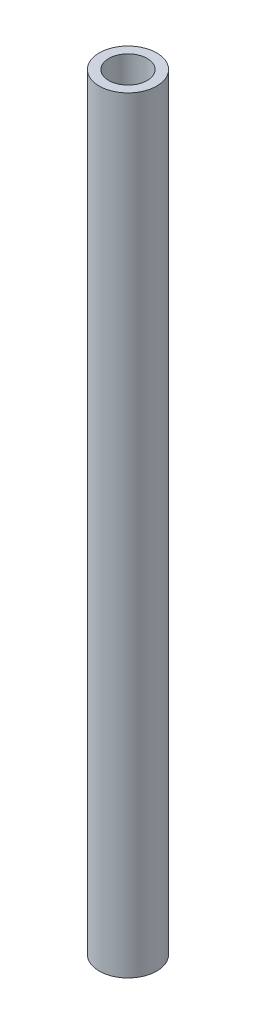
ISO-10303-21;
HEADER;
FILE_DESCRIPTION(('STEP AP214'),'2;1');
FILE_NAME('part.step','',(''),(''),'','','');
FILE_SCHEMA(('AUTOMOTIVE_DESIGN { 1 0 10303 214 1 1 1 1 }'));
ENDSEC;
DATA;
#1=APPLICATION_CONTEXT('core data for automotive mechanical design processes');
#2=APPLICATION_PROTOCOL_DEFINITION('international standard','automotive_design',2000,#1);
#3=PRODUCT_CONTEXT('',#1,'mechanical');
#4=PRODUCT('Part','Part','',(#3));
#5=PRODUCT_RELATED_PRODUCT_CATEGORY('part','',(#4));
#6=PRODUCT_DEFINITION_FORMATION('','',#4);
#7=PRODUCT_DEFINITION_CONTEXT('part definition',#1,'design');
#8=PRODUCT_DEFINITION('design','',#6,#7);
#9=PRODUCT_DEFINITION_SHAPE('','',#8);
#10=(LENGTH_UNIT() NAMED_UNIT(*) SI_UNIT(.MILLI.,.METRE.));
#11=(NAMED_UNIT(*) PLANE_ANGLE_UNIT() SI_UNIT($,.RADIAN.));
#12=(NAMED_UNIT(*) SI_UNIT($,.STERADIAN.) SOLID_ANGLE_UNIT());
#13=UNCERTAINTY_MEASURE_WITH_UNIT(LENGTH_MEASURE(1.E-05),#10,'distance_accuracy_value','');
#14=(GEOMETRIC_REPRESENTATION_CONTEXT(3) GLOBAL_UNCERTAINTY_ASSIGNED_CONTEXT((#13)) GLOBAL_UNIT_ASSIGNED_CONTEXT((#10,
#11,#12)) REPRESENTATION_CONTEXT('',''));
#15=CARTESIAN_POINT('',(0.,0.,0.));
#16=DIRECTION('',(0.,0.,1.));
#17=DIRECTION('',(1.,0.,0.));
#18=AXIS2_PLACEMENT_3D('',#15,#16,#17);
#19=CARTESIAN_POINT('',(0.,400.,0.));
#20=DIRECTION('',(0.,1.,0.));
#21=DIRECTION('',(0.,0.,1.));
#22=AXIS2_PLACEMENT_3D('',#19,#20,#21);
#23=PLANE('',#22);
#24=CARTESIAN_POINT('',(0.,400.,0.));
#25=DIRECTION('',(0.,1.,0.));
#26=DIRECTION('',(0.,0.,1.));
#27=AXIS2_PLACEMENT_3D('',#24,#25,#26);
#28=CIRCLE('',#27,15.);
#29=CARTESIAN_POINT('',(0.,400.,15.));
#30=VERTEX_POINT('',#29);
#31=EDGE_CURVE('E10',#30,#30,#28,.T.);
#32=ORIENTED_EDGE('',*,*,#31,.T.);
#33=EDGE_LOOP('',(#32));
#34=FACE_BOUND('',#33,.T.);
#35=CARTESIAN_POINT('',(0.,400.,0.));
#36=DIRECTION('',(0.,1.,0.));
#37=DIRECTION('',(0.,0.,1.));
#38=AXIS2_PLACEMENT_3D('',#35,#36,#37);
#39=CIRCLE('',#38,10.);
#40=CARTESIAN_POINT('',(0.,400.,10.));
#41=VERTEX_POINT('',#40);
#42=EDGE_CURVE('E42',#41,#41,#39,.T.);
#43=ORIENTED_EDGE('',*,*,#42,.F.);
#44=EDGE_LOOP('',(#43));
#45=FACE_BOUND('',#44,.T.);
#46=ADVANCED_FACE('F31',(#34,#45),#23,.T.);
#47=CARTESIAN_POINT('',(0.,0.,0.));
#48=DIRECTION('',(0.,1.,0.));
#49=DIRECTION('',(0.,0.,1.));
#50=AXIS2_PLACEMENT_3D('',#47,#48,#49);
#51=PLANE('',#50);
#52=CARTESIAN_POINT('',(0.,0.,0.));
#53=DIRECTION('',(0.,1.,0.));
#54=DIRECTION('',(0.,0.,1.));
#55=AXIS2_PLACEMENT_3D('',#52,#53,#54);
#56=CIRCLE('',#55,15.);
#57=CARTESIAN_POINT('',(0.,0.,15.));
#58=VERTEX_POINT('',#57);
#59=EDGE_CURVE('E35',#58,#58,#56,.T.);
#60=ORIENTED_EDGE('',*,*,#59,.F.);
#61=EDGE_LOOP('',(#60));
#62=FACE_BOUND('',#61,.T.);
#63=CARTESIAN_POINT('',(0.,0.,0.));
#64=DIRECTION('',(0.,1.,0.));
#65=DIRECTION('',(0.,0.,1.));
#66=AXIS2_PLACEMENT_3D('',#63,#64,#65);
#67=CIRCLE('',#66,10.);
#68=CARTESIAN_POINT('',(0.,0.,10.));
#69=VERTEX_POINT('',#68);
#70=EDGE_CURVE('E44',#69,#69,#67,.T.);
#71=ORIENTED_EDGE('',*,*,#70,.T.);
#72=EDGE_LOOP('',(#71));
#73=FACE_BOUND('',#72,.T.);
#74=ADVANCED_FACE('F54',(#62,#73),#51,.F.);
#75=CARTESIAN_POINT('',(0.,400.,0.));
#76=DIRECTION('',(0.,-1.,0.));
#77=DIRECTION('',(0.,0.,-1.));
#78=AXIS2_PLACEMENT_3D('',#75,#76,#77);
#79=CYLINDRICAL_SURFACE('',#78,15.);
#80=ORIENTED_EDGE('',*,*,#31,.F.);
#81=EDGE_LOOP('',(#80));
#82=FACE_BOUND('',#81,.T.);
#83=ORIENTED_EDGE('',*,*,#59,.T.);
#84=EDGE_LOOP('',(#83));
#85=FACE_BOUND('',#84,.T.);
#86=ADVANCED_FACE('F33',(#82,#85),#79,.T.);
#87=CARTESIAN_POINT('',(0.,400.,0.));
#88=DIRECTION('',(0.,-1.,0.));
#89=DIRECTION('',(0.,0.,-1.));
#90=AXIS2_PLACEMENT_3D('',#87,#88,#89);
#91=CYLINDRICAL_SURFACE('',#90,10.);
#92=ORIENTED_EDGE('',*,*,#42,.T.);
#93=EDGE_LOOP('',(#92));
#94=FACE_BOUND('',#93,.T.);
#95=ORIENTED_EDGE('',*,*,#70,.F.);
#96=EDGE_LOOP('',(#95));
#97=FACE_BOUND('',#96,.T.);
#98=ADVANCED_FACE('F50',(#94,#97),#91,.F.);
#99=CLOSED_SHELL('',(#46,#74,#86,#98));
#100=MANIFOLD_SOLID_BREP('B2',#99);
#101=ADVANCED_BREP_SHAPE_REPRESENTATION('',(#18,#100),#14);
#102=SHAPE_DEFINITION_REPRESENTATION(#9,#101);
ENDSEC;
END-ISO-10303-21;
